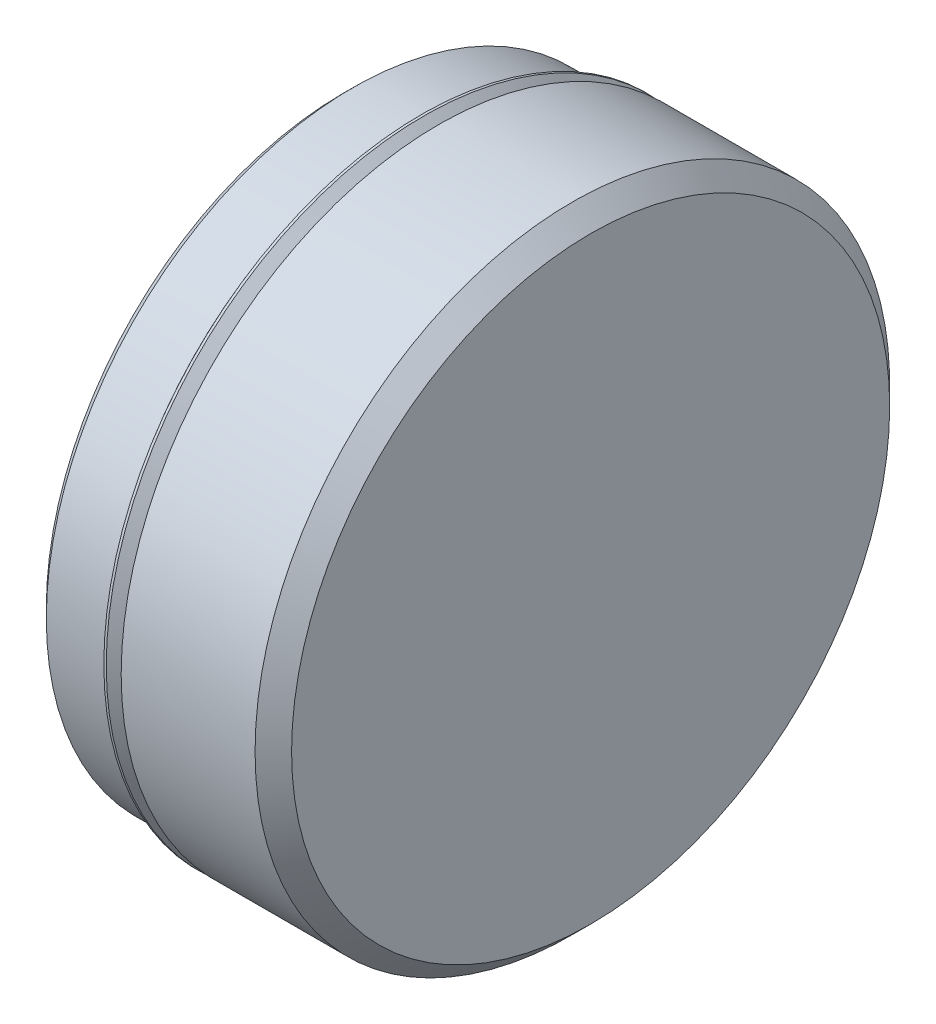
ISO-10303-21;
HEADER;
FILE_DESCRIPTION(('STEP AP214'),'2;1');
FILE_NAME('part.step','',(''),(''),'','','');
FILE_SCHEMA(('AUTOMOTIVE_DESIGN { 1 0 10303 214 1 1 1 1 }'));
ENDSEC;
DATA;
#1=APPLICATION_CONTEXT('core data for automotive mechanical design processes');
#2=APPLICATION_PROTOCOL_DEFINITION('international standard','automotive_design',2000,#1);
#3=PRODUCT_CONTEXT('',#1,'mechanical');
#4=PRODUCT('Part','Part','',(#3));
#5=PRODUCT_RELATED_PRODUCT_CATEGORY('part','',(#4));
#6=PRODUCT_DEFINITION_FORMATION('','',#4);
#7=PRODUCT_DEFINITION_CONTEXT('part definition',#1,'design');
#8=PRODUCT_DEFINITION('design','',#6,#7);
#9=PRODUCT_DEFINITION_SHAPE('','',#8);
#10=(LENGTH_UNIT() NAMED_UNIT(*) SI_UNIT(.MILLI.,.METRE.));
#11=(NAMED_UNIT(*) PLANE_ANGLE_UNIT() SI_UNIT($,.RADIAN.));
#12=(NAMED_UNIT(*) SI_UNIT($,.STERADIAN.) SOLID_ANGLE_UNIT());
#13=UNCERTAINTY_MEASURE_WITH_UNIT(LENGTH_MEASURE(1.E-05),#10,'distance_accuracy_value','');
#14=(GEOMETRIC_REPRESENTATION_CONTEXT(3) GLOBAL_UNCERTAINTY_ASSIGNED_CONTEXT((#13)) GLOBAL_UNIT_ASSIGNED_CONTEXT((#10,
#11,#12)) REPRESENTATION_CONTEXT('',''));
#15=CARTESIAN_POINT('',(0.,0.,0.));
#16=DIRECTION('',(0.,0.,1.));
#17=DIRECTION('',(1.,0.,0.));
#18=AXIS2_PLACEMENT_3D('',#15,#16,#17);
#19=CARTESIAN_POINT('',(0.,0.,0.));
#20=DIRECTION('',(1.,0.,0.));
#21=DIRECTION('',(0.,0.,-1.));
#22=AXIS2_PLACEMENT_3D('',#19,#20,#21);
#23=PLANE('',#22);
#24=CARTESIAN_POINT('',(0.,0.,0.));
#25=DIRECTION('',(-1.,0.,0.));
#26=DIRECTION('',(0.,0.,1.));
#27=AXIS2_PLACEMENT_3D('',#24,#25,#26);
#28=CIRCLE('',#27,24.80945);
#29=CARTESIAN_POINT('',(0.,0.,24.80945));
#30=VERTEX_POINT('',#29);
#31=EDGE_CURVE('E42',#30,#30,#28,.T.);
#32=ORIENTED_EDGE('',*,*,#31,.T.);
#33=EDGE_LOOP('',(#32));
#34=FACE_BOUND('',#33,.T.);
#35=CARTESIAN_POINT('',(0.,0.,0.));
#36=DIRECTION('',(-1.,0.,0.));
#37=DIRECTION('',(0.,0.,1.));
#38=AXIS2_PLACEMENT_3D('',#35,#36,#37);
#39=CIRCLE('',#38,20.5994);
#40=CARTESIAN_POINT('',(0.,0.,20.5994));
#41=VERTEX_POINT('',#40);
#42=EDGE_CURVE('E81',#41,#41,#39,.T.);
#43=ORIENTED_EDGE('',*,*,#42,.F.);
#44=EDGE_LOOP('',(#43));
#45=FACE_BOUND('',#44,.T.);
#46=ADVANCED_FACE('F32',(#34,#45),#23,.F.);
#47=CARTESIAN_POINT('',(20.6248,0.,0.));
#48=DIRECTION('',(-1.,0.,0.));
#49=DIRECTION('',(0.,0.,1.));
#50=AXIS2_PLACEMENT_3D('',#47,#48,#49);
#51=CYLINDRICAL_SURFACE('',#50,24.51735);
#52=CARTESIAN_POINT('',(6.8707,0.,0.));
#53=DIRECTION('',(-1.,0.,0.));
#54=DIRECTION('',(0.,0.,1.));
#55=AXIS2_PLACEMENT_3D('',#52,#53,#54);
#56=CIRCLE('',#55,24.51735);
#57=CARTESIAN_POINT('',(6.8707,0.,24.51735));
#58=VERTEX_POINT('',#57);
#59=EDGE_CURVE('E54',#58,#58,#56,.T.);
#60=ORIENTED_EDGE('',*,*,#59,.F.);
#61=EDGE_LOOP('',(#60));
#62=FACE_BOUND('',#61,.T.);
#63=CARTESIAN_POINT('',(7.39775,0.,0.));
#64=DIRECTION('',(1.,0.,0.));
#65=DIRECTION('',(0.,0.,-1.));
#66=AXIS2_PLACEMENT_3D('',#63,#64,#65);
#67=CIRCLE('',#66,24.51735);
#68=CARTESIAN_POINT('',(7.39775,0.,-24.51735));
#69=VERTEX_POINT('',#68);
#70=EDGE_CURVE('E10',#69,#69,#67,.T.);
#71=ORIENTED_EDGE('',*,*,#70,.F.);
#72=EDGE_LOOP('',(#71));
#73=FACE_BOUND('',#72,.T.);
#74=ADVANCED_FACE('F116',(#62,#73),#51,.T.);
#75=CARTESIAN_POINT('',(0.761999999999999,0.,0.));
#76=DIRECTION('',(1.,0.,0.));
#77=DIRECTION('',(0.,0.,-1.));
#78=AXIS2_PLACEMENT_3D('',#75,#76,#77);
#79=CONICAL_SURFACE('',#78,25.57145,0.785398163397448);
#80=ORIENTED_EDGE('',*,*,#31,.F.);
#81=EDGE_LOOP('',(#80));
#82=FACE_BOUND('',#81,.T.);
#83=CARTESIAN_POINT('',(0.761999999999999,0.,0.));
#84=DIRECTION('',(-1.,0.,0.));
#85=DIRECTION('',(0.,0.,1.));
#86=AXIS2_PLACEMENT_3D('',#83,#84,#85);
#87=CIRCLE('',#86,25.57145);
#88=CARTESIAN_POINT('',(0.761999999999999,0.,25.57145));
#89=VERTEX_POINT('',#88);
#90=EDGE_CURVE('E46',#89,#89,#87,.T.);
#91=ORIENTED_EDGE('',*,*,#90,.T.);
#92=EDGE_LOOP('',(#91));
#93=FACE_BOUND('',#92,.T.);
#94=ADVANCED_FACE('F121',(#82,#93),#79,.T.);
#95=CARTESIAN_POINT('',(20.6248,0.,0.));
#96=DIRECTION('',(-1.,0.,0.));
#97=DIRECTION('',(0.,0.,1.));
#98=AXIS2_PLACEMENT_3D('',#95,#96,#97);
#99=CYLINDRICAL_SURFACE('',#98,25.57145);
#100=ORIENTED_EDGE('',*,*,#90,.F.);
#101=EDGE_LOOP('',(#100));
#102=FACE_BOUND('',#101,.T.);
#103=CARTESIAN_POINT('',(5.8166,0.,0.));
#104=DIRECTION('',(-1.,0.,0.));
#105=DIRECTION('',(0.,0.,1.));
#106=AXIS2_PLACEMENT_3D('',#103,#104,#105);
#107=CIRCLE('',#106,25.57145);
#108=CARTESIAN_POINT('',(5.8166,0.,25.57145));
#109=VERTEX_POINT('',#108);
#110=EDGE_CURVE('E51',#109,#109,#107,.T.);
#111=ORIENTED_EDGE('',*,*,#110,.T.);
#112=EDGE_LOOP('',(#111));
#113=FACE_BOUND('',#112,.T.);
#114=ADVANCED_FACE('F191',(#102,#113),#99,.T.);
#115=CARTESIAN_POINT('',(6.8707,0.,0.));
#116=DIRECTION('',(-1.,0.,0.));
#117=DIRECTION('',(0.,0.,1.));
#118=AXIS2_PLACEMENT_3D('',#115,#116,#117);
#119=CONICAL_SURFACE('',#118,24.51735,0.785398163397448);
#120=ORIENTED_EDGE('',*,*,#110,.F.);
#121=EDGE_LOOP('',(#120));
#122=FACE_BOUND('',#121,.T.);
#123=ORIENTED_EDGE('',*,*,#59,.T.);
#124=EDGE_LOOP('',(#123));
#125=FACE_BOUND('',#124,.T.);
#126=ADVANCED_FACE('F173',(#122,#125),#119,.T.);
#127=CARTESIAN_POINT('',(6.4770907119717,26.48585,0.));
#128=DIRECTION('',(1.,0.,0.));
#129=DIRECTION('',(0.,0.,-1.));
#130=AXIS2_PLACEMENT_3D('',#127,#128,#129);
#131=PLANE('',#130);
#132=CARTESIAN_POINT('',(6.4770907119717,0.,0.));
#133=DIRECTION('',(-1.,0.,0.));
#134=DIRECTION('',(0.,0.,1.));
#135=AXIS2_PLACEMENT_3D('',#132,#133,#134);
#136=CIRCLE('',#135,26.401681804126);
#137=CARTESIAN_POINT('',(6.4770907119717,0.,26.401681804126));
#138=VERTEX_POINT('',#137);
#139=EDGE_CURVE('E78',#138,#138,#136,.T.);
#140=ORIENTED_EDGE('',*,*,#139,.F.);
#141=EDGE_LOOP('',(#140));
#142=FACE_BOUND('',#141,.T.);
#143=CARTESIAN_POINT('',(6.4770907119717,0.,0.));
#144=DIRECTION('',(-1.,0.,0.));
#145=DIRECTION('',(0.,0.,1.));
#146=AXIS2_PLACEMENT_3D('',#143,#144,#145);
#147=CIRCLE('',#146,26.48585);
#148=CARTESIAN_POINT('',(6.4770907119717,0.,26.48585));
#149=VERTEX_POINT('',#148);
#150=EDGE_CURVE('E66',#149,#149,#147,.T.);
#151=ORIENTED_EDGE('',*,*,#150,.T.);
#152=EDGE_LOOP('',(#151));
#153=FACE_BOUND('',#152,.T.);
#154=ADVANCED_FACE('F169',(#142,#153),#131,.F.);
#155=CARTESIAN_POINT('',(7.9248,0.,0.));
#156=DIRECTION('',(-1.,0.,0.));
#157=DIRECTION('',(0.,0.,1.));
#158=AXIS2_PLACEMENT_3D('',#155,#156,#157);
#159=CYLINDRICAL_SURFACE('',#158,26.48585);
#160=ORIENTED_EDGE('',*,*,#150,.F.);
#161=EDGE_LOOP('',(#160));
#162=FACE_BOUND('',#161,.T.);
#163=CARTESIAN_POINT('',(6.6802907119717,0.,0.));
#164=DIRECTION('',(-1.,0.,0.));
#165=DIRECTION('',(0.,0.,1.));
#166=AXIS2_PLACEMENT_3D('',#163,#164,#165);
#167=CIRCLE('',#166,26.48585);
#168=CARTESIAN_POINT('',(6.6802907119717,0.,26.48585));
#169=VERTEX_POINT('',#168);
#170=EDGE_CURVE('E69',#169,#169,#167,.T.);
#171=ORIENTED_EDGE('',*,*,#170,.T.);
#172=EDGE_LOOP('',(#171));
#173=FACE_BOUND('',#172,.T.);
#174=ADVANCED_FACE('F165',(#162,#173),#159,.T.);
#175=CARTESIAN_POINT('',(7.9248,0.,0.));
#176=DIRECTION('',(-1.,0.,0.));
#177=DIRECTION('',(0.,0.,1.));
#178=AXIS2_PLACEMENT_3D('',#175,#176,#177);
#179=CONICAL_SURFACE('',#178,25.241340711972,0.785398163397327);
#180=ORIENTED_EDGE('',*,*,#170,.F.);
#181=EDGE_LOOP('',(#180));
#182=FACE_BOUND('',#181,.T.);
#183=CARTESIAN_POINT('',(7.9248,0.,0.));
#184=DIRECTION('',(1.,0.,0.));
#185=DIRECTION('',(0.,0.,-1.));
#186=AXIS2_PLACEMENT_3D('',#183,#184,#185);
#187=CIRCLE('',#186,25.241340711972);
#188=CARTESIAN_POINT('',(7.9248,0.,-25.241340711972));
#189=VERTEX_POINT('',#188);
#190=EDGE_CURVE('E38',#189,#189,#187,.F.);
#191=ORIENTED_EDGE('',*,*,#190,.T.);
#192=EDGE_LOOP('',(#191));
#193=FACE_BOUND('',#192,.T.);
#194=ADVANCED_FACE('F162',(#182,#193),#179,.T.);
#195=CARTESIAN_POINT('',(7.78978369683835,0.,0.));
#196=DIRECTION('',(1.,0.,0.));
#197=DIRECTION('',(0.,0.,-1.));
#198=AXIS2_PLACEMENT_3D('',#195,#196,#197);
#199=CONICAL_SURFACE('',#198,24.9093836968384,0.78539816339745);
#200=ORIENTED_EDGE('',*,*,#70,.T.);
#201=EDGE_LOOP('',(#200));
#202=FACE_BOUND('',#201,.T.);
#203=CARTESIAN_POINT('',(7.78978369683835,0.,0.));
#204=DIRECTION('',(-1.,0.,0.));
#205=DIRECTION('',(0.,0.,1.));
#206=AXIS2_PLACEMENT_3D('',#203,#204,#205);
#207=CIRCLE('',#206,24.9093836968384);
#208=CARTESIAN_POINT('',(7.78978369683835,0.,24.9093836968384));
#209=VERTEX_POINT('',#208);
#210=EDGE_CURVE('E72',#209,#209,#207,.T.);
#211=ORIENTED_EDGE('',*,*,#210,.T.);
#212=EDGE_LOOP('',(#211));
#213=FACE_BOUND('',#212,.T.);
#214=ADVANCED_FACE('F158',(#202,#213),#199,.T.);
#215=CARTESIAN_POINT('',(7.69998113562809,0.,0.));
#216=DIRECTION('',(-1.,0.,0.));
#217=DIRECTION('',(0.,0.,1.));
#218=AXIS2_PLACEMENT_3D('',#215,#216,#217);
#219=TOROIDAL_SURFACE('',#218,24.9991862580489,0.126999999999558);
#220=ORIENTED_EDGE('',*,*,#210,.F.);
#221=EDGE_LOOP('',(#220));
#222=FACE_BOUND('',#221,.T.);
#223=CARTESIAN_POINT('',(7.78978369683835,0.,0.));
#224=DIRECTION('',(-1.,0.,0.));
#225=DIRECTION('',(0.,0.,1.));
#226=AXIS2_PLACEMENT_3D('',#223,#224,#225);
#227=CIRCLE('',#226,25.0889888192594);
#228=CARTESIAN_POINT('',(7.78978369683835,0.,25.0889888192594));
#229=VERTEX_POINT('',#228);
#230=EDGE_CURVE('E75',#229,#229,#227,.T.);
#231=ORIENTED_EDGE('',*,*,#230,.T.);
#232=EDGE_LOOP('',(#231));
#233=FACE_BOUND('',#232,.T.);
#234=ADVANCED_FACE('F154',(#222,#233),#219,.F.);
#235=CARTESIAN_POINT('',(6.4770907119717,0.,0.));
#236=DIRECTION('',(-1.,0.,0.));
#237=DIRECTION('',(0.,0.,1.));
#238=AXIS2_PLACEMENT_3D('',#235,#236,#237);
#239=CONICAL_SURFACE('',#238,26.401681804126,0.785398163397449);
#240=ORIENTED_EDGE('',*,*,#230,.F.);
#241=EDGE_LOOP('',(#240));
#242=FACE_BOUND('',#241,.T.);
#243=ORIENTED_EDGE('',*,*,#139,.T.);
#244=EDGE_LOOP('',(#243));
#245=FACE_BOUND('',#244,.T.);
#246=ADVANCED_FACE('F150',(#242,#245),#239,.F.);
#247=CARTESIAN_POINT('',(20.6248,24.96185,0.));
#248=DIRECTION('',(-1.,0.,0.));
#249=DIRECTION('',(0.,0.,1.));
#250=AXIS2_PLACEMENT_3D('',#247,#248,#249);
#251=PLANE('',#250);
#252=CARTESIAN_POINT('',(20.6248,0.,0.));
#253=DIRECTION('',(-1.,0.,0.));
#254=DIRECTION('',(0.,0.,1.));
#255=AXIS2_PLACEMENT_3D('',#252,#253,#254);
#256=CIRCLE('',#255,24.96185);
#257=CARTESIAN_POINT('',(20.6248,0.,24.96185));
#258=VERTEX_POINT('',#257);
#259=EDGE_CURVE('E63',#258,#258,#256,.T.);
#260=ORIENTED_EDGE('',*,*,#259,.F.);
#261=EDGE_LOOP('',(#260));
#262=FACE_BOUND('',#261,.T.);
#263=ADVANCED_FACE('F153',(#262),#251,.F.);
#264=CARTESIAN_POINT('',(20.6248,0.,0.));
#265=DIRECTION('',(-1.,0.,0.));
#266=DIRECTION('',(0.,0.,1.));
#267=AXIS2_PLACEMENT_3D('',#264,#265,#266);
#268=CONICAL_SURFACE('',#267,24.96185,0.785398163397448);
#269=CARTESIAN_POINT('',(19.1008,0.,0.));
#270=DIRECTION('',(-1.,0.,0.));
#271=DIRECTION('',(0.,0.,1.));
#272=AXIS2_PLACEMENT_3D('',#269,#270,#271);
#273=CIRCLE('',#272,26.48585);
#274=CARTESIAN_POINT('',(19.1008,0.,26.48585));
#275=VERTEX_POINT('',#274);
#276=EDGE_CURVE('E60',#275,#275,#273,.T.);
#277=ORIENTED_EDGE('',*,*,#276,.F.);
#278=EDGE_LOOP('',(#277));
#279=FACE_BOUND('',#278,.T.);
#280=ORIENTED_EDGE('',*,*,#259,.T.);
#281=EDGE_LOOP('',(#280));
#282=FACE_BOUND('',#281,.T.);
#283=ADVANCED_FACE('F177',(#279,#282),#268,.T.);
#284=CARTESIAN_POINT('',(20.6248,0.,0.));
#285=DIRECTION('',(-1.,0.,0.));
#286=DIRECTION('',(0.,0.,1.));
#287=AXIS2_PLACEMENT_3D('',#284,#285,#286);
#288=CYLINDRICAL_SURFACE('',#287,26.48585);
#289=CARTESIAN_POINT('',(7.9248,0.,0.));
#290=DIRECTION('',(-1.,0.,0.));
#291=DIRECTION('',(0.,0.,1.));
#292=AXIS2_PLACEMENT_3D('',#289,#290,#291);
#293=CIRCLE('',#292,26.48585);
#294=CARTESIAN_POINT('',(7.9248,0.,26.48585));
#295=VERTEX_POINT('',#294);
#296=EDGE_CURVE('E57',#295,#295,#293,.T.);
#297=ORIENTED_EDGE('',*,*,#296,.F.);
#298=EDGE_LOOP('',(#297));
#299=FACE_BOUND('',#298,.T.);
#300=ORIENTED_EDGE('',*,*,#276,.T.);
#301=EDGE_LOOP('',(#300));
#302=FACE_BOUND('',#301,.T.);
#303=ADVANCED_FACE('F181',(#299,#302),#288,.T.);
#304=CARTESIAN_POINT('',(7.9248,24.51735,0.));
#305=DIRECTION('',(1.,0.,0.));
#306=DIRECTION('',(0.,0.,-1.));
#307=AXIS2_PLACEMENT_3D('',#304,#305,#306);
#308=PLANE('',#307);
#309=ORIENTED_EDGE('',*,*,#296,.T.);
#310=EDGE_LOOP('',(#309));
#311=FACE_BOUND('',#310,.T.);
#312=ORIENTED_EDGE('',*,*,#190,.F.);
#313=EDGE_LOOP('',(#312));
#314=FACE_BOUND('',#313,.T.);
#315=ADVANCED_FACE('F132',(#311,#314),#308,.F.);
#316=CARTESIAN_POINT('',(0.762000000000001,0.,0.));
#317=DIRECTION('',(-1.,0.,0.));
#318=DIRECTION('',(0.,0.,1.));
#319=AXIS2_PLACEMENT_3D('',#316,#317,#318);
#320=CONICAL_SURFACE('',#319,19.8374,0.78539816339745);
#321=ORIENTED_EDGE('',*,*,#42,.T.);
#322=EDGE_LOOP('',(#321));
#323=FACE_BOUND('',#322,.T.);
#324=CARTESIAN_POINT('',(0.762000000000001,0.,0.));
#325=DIRECTION('',(-1.,0.,0.));
#326=DIRECTION('',(0.,0.,1.));
#327=AXIS2_PLACEMENT_3D('',#324,#325,#326);
#328=CIRCLE('',#327,19.8374);
#329=CARTESIAN_POINT('',(0.762000000000001,0.,19.8374));
#330=VERTEX_POINT('',#329);
#331=EDGE_CURVE('E84',#330,#330,#328,.T.);
#332=ORIENTED_EDGE('',*,*,#331,.F.);
#333=EDGE_LOOP('',(#332));
#334=FACE_BOUND('',#333,.T.);
#335=ADVANCED_FACE('F128',(#323,#334),#320,.F.);
#336=CARTESIAN_POINT('',(12.7,0.,0.));
#337=DIRECTION('',(-1.,0.,0.));
#338=DIRECTION('',(0.,0.,1.));
#339=AXIS2_PLACEMENT_3D('',#336,#337,#338);
#340=CYLINDRICAL_SURFACE('',#339,19.8374);
#341=ORIENTED_EDGE('',*,*,#331,.T.);
#342=EDGE_LOOP('',(#341));
#343=FACE_BOUND('',#342,.T.);
#344=CARTESIAN_POINT('',(3.175,0.,0.));
#345=DIRECTION('',(-1.,0.,0.));
#346=DIRECTION('',(0.,0.,1.));
#347=AXIS2_PLACEMENT_3D('',#344,#345,#346);
#348=CIRCLE('',#347,19.8374);
#349=CARTESIAN_POINT('',(3.175,0.,19.8374));
#350=VERTEX_POINT('',#349);
#351=EDGE_CURVE('E87',#350,#350,#348,.T.);
#352=ORIENTED_EDGE('',*,*,#351,.F.);
#353=EDGE_LOOP('',(#352));
#354=FACE_BOUND('',#353,.T.);
#355=ADVANCED_FACE('F131',(#343,#354),#340,.F.);
#356=CARTESIAN_POINT('',(3.175,19.8374,0.));
#357=DIRECTION('',(-1.,0.,0.));
#358=DIRECTION('',(0.,0.,1.));
#359=AXIS2_PLACEMENT_3D('',#356,#357,#358);
#360=PLANE('',#359);
#361=ORIENTED_EDGE('',*,*,#351,.T.);
#362=EDGE_LOOP('',(#361));
#363=FACE_BOUND('',#362,.T.);
#364=CARTESIAN_POINT('',(3.175,0.,0.));
#365=DIRECTION('',(-1.,0.,0.));
#366=DIRECTION('',(0.,0.,1.));
#367=AXIS2_PLACEMENT_3D('',#364,#365,#366);
#368=CIRCLE('',#367,16.59255);
#369=CARTESIAN_POINT('',(3.175,0.,16.59255));
#370=VERTEX_POINT('',#369);
#371=EDGE_CURVE('E90',#370,#370,#368,.T.);
#372=ORIENTED_EDGE('',*,*,#371,.F.);
#373=EDGE_LOOP('',(#372));
#374=FACE_BOUND('',#373,.T.);
#375=ADVANCED_FACE('F112',(#363,#374),#360,.T.);
#376=CARTESIAN_POINT('',(3.937,0.,0.));
#377=DIRECTION('',(-1.,0.,0.));
#378=DIRECTION('',(0.,0.,1.));
#379=AXIS2_PLACEMENT_3D('',#376,#377,#378);
#380=CONICAL_SURFACE('',#379,15.83055,0.785398163397448);
#381=ORIENTED_EDGE('',*,*,#371,.T.);
#382=EDGE_LOOP('',(#381));
#383=FACE_BOUND('',#382,.T.);
#384=CARTESIAN_POINT('',(3.937,0.,0.));
#385=DIRECTION('',(-1.,0.,0.));
#386=DIRECTION('',(0.,0.,1.));
#387=AXIS2_PLACEMENT_3D('',#384,#385,#386);
#388=CIRCLE('',#387,15.83055);
#389=CARTESIAN_POINT('',(3.937,0.,15.83055));
#390=VERTEX_POINT('',#389);
#391=EDGE_CURVE('E93',#390,#390,#388,.T.);
#392=ORIENTED_EDGE('',*,*,#391,.F.);
#393=EDGE_LOOP('',(#392));
#394=FACE_BOUND('',#393,.T.);
#395=ADVANCED_FACE('F104',(#383,#394),#380,.F.);
#396=CARTESIAN_POINT('',(12.7,0.,0.));
#397=DIRECTION('',(-1.,0.,0.));
#398=DIRECTION('',(0.,0.,1.));
#399=AXIS2_PLACEMENT_3D('',#396,#397,#398);
#400=CYLINDRICAL_SURFACE('',#399,15.83055);
#401=ORIENTED_EDGE('',*,*,#391,.T.);
#402=EDGE_LOOP('',(#401));
#403=FACE_BOUND('',#402,.T.);
#404=CARTESIAN_POINT('',(12.7,0.,0.));
#405=DIRECTION('',(-1.,0.,0.));
#406=DIRECTION('',(0.,0.,1.));
#407=AXIS2_PLACEMENT_3D('',#404,#405,#406);
#408=CIRCLE('',#407,15.83055);
#409=CARTESIAN_POINT('',(12.7,0.,15.83055));
#410=VERTEX_POINT('',#409);
#411=EDGE_CURVE('E96',#410,#410,#408,.T.);
#412=ORIENTED_EDGE('',*,*,#411,.F.);
#413=EDGE_LOOP('',(#412));
#414=FACE_BOUND('',#413,.T.);
#415=ADVANCED_FACE('F102',(#403,#414),#400,.F.);
#416=CARTESIAN_POINT('',(12.7,15.83055,0.));
#417=DIRECTION('',(-1.,0.,0.));
#418=DIRECTION('',(0.,0.,1.));
#419=AXIS2_PLACEMENT_3D('',#416,#417,#418);
#420=PLANE('',#419);
#421=ORIENTED_EDGE('',*,*,#411,.T.);
#422=EDGE_LOOP('',(#421));
#423=FACE_BOUND('',#422,.T.);
#424=ADVANCED_FACE('F100',(#423),#420,.T.);
#425=CLOSED_SHELL('',(#46,#74,#94,#114,#126,#154,#174,#194,#214,#234,#246,#263,#283,#303,#315,
#335,#355,#375,#395,#415,#424));
#426=MANIFOLD_SOLID_BREP('B2',#425);
#427=ADVANCED_BREP_SHAPE_REPRESENTATION('',(#18,#426),#14);
#428=SHAPE_DEFINITION_REPRESENTATION(#9,#427);
ENDSEC;
END-ISO-10303-21;
